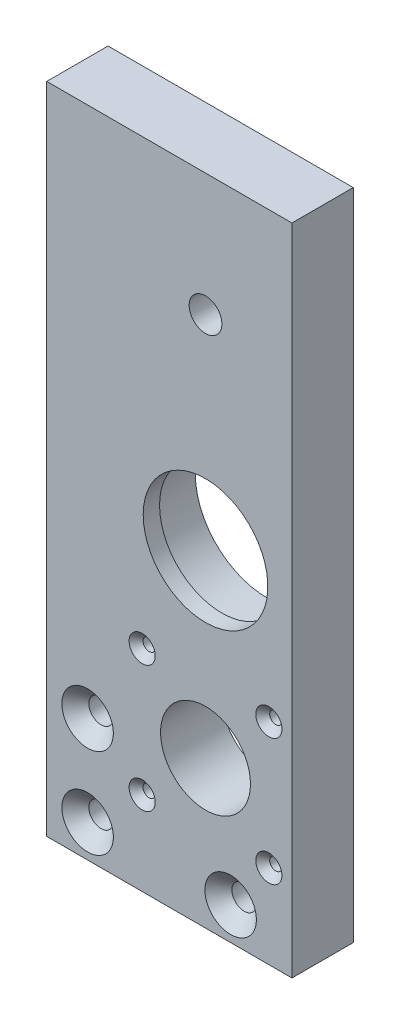
ISO-10303-21;
HEADER;
FILE_DESCRIPTION(('STEP AP214'),'2;1');
FILE_NAME('part.step','',(''),(''),'','','');
FILE_SCHEMA(('AUTOMOTIVE_DESIGN { 1 0 10303 214 1 1 1 1 }'));
ENDSEC;
DATA;
#1=APPLICATION_CONTEXT('core data for automotive mechanical design processes');
#2=APPLICATION_PROTOCOL_DEFINITION('international standard','automotive_design',2000,#1);
#3=PRODUCT_CONTEXT('',#1,'mechanical');
#4=PRODUCT('Part','Part','',(#3));
#5=PRODUCT_RELATED_PRODUCT_CATEGORY('part','',(#4));
#6=PRODUCT_DEFINITION_FORMATION('','',#4);
#7=PRODUCT_DEFINITION_CONTEXT('part definition',#1,'design');
#8=PRODUCT_DEFINITION('design','',#6,#7);
#9=PRODUCT_DEFINITION_SHAPE('','',#8);
#10=(LENGTH_UNIT() NAMED_UNIT(*) SI_UNIT(.MILLI.,.METRE.));
#11=(NAMED_UNIT(*) PLANE_ANGLE_UNIT() SI_UNIT($,.RADIAN.));
#12=(NAMED_UNIT(*) SI_UNIT($,.STERADIAN.) SOLID_ANGLE_UNIT());
#13=UNCERTAINTY_MEASURE_WITH_UNIT(LENGTH_MEASURE(1.E-05),#10,'distance_accuracy_value','');
#14=(GEOMETRIC_REPRESENTATION_CONTEXT(3) GLOBAL_UNCERTAINTY_ASSIGNED_CONTEXT((#13)) GLOBAL_UNIT_ASSIGNED_CONTEXT((#10,
#11,#12)) REPRESENTATION_CONTEXT('',''));
#15=CARTESIAN_POINT('',(0.,0.,0.));
#16=DIRECTION('',(0.,0.,1.));
#17=DIRECTION('',(1.,0.,0.));
#18=AXIS2_PLACEMENT_3D('',#15,#16,#17);
#19=CARTESIAN_POINT('',(0.,0.,15.));
#20=DIRECTION('',(0.,1.,0.));
#21=DIRECTION('',(0.,0.,1.));
#22=AXIS2_PLACEMENT_3D('',#19,#20,#21);
#23=PLANE('',#22);
#24=DIRECTION('',(0.,0.,1.));
#25=VECTOR('',#24,1.);
#26=CARTESIAN_POINT('',(5.,0.,0.));
#27=LINE('',#26,#25);
#28=CARTESIAN_POINT('',(5.,0.,0.));
#29=VERTEX_POINT('',#28);
#30=CARTESIAN_POINT('',(5.,0.,15.));
#31=VERTEX_POINT('',#30);
#32=EDGE_CURVE('E261',#29,#31,#27,.T.);
#33=ORIENTED_EDGE('',*,*,#32,.F.);
#34=DIRECTION('',(1.,0.,0.));
#35=VECTOR('',#34,1.);
#36=CARTESIAN_POINT('',(0.,0.,0.));
#37=LINE('',#36,#35);
#38=CARTESIAN_POINT('',(65.,0.,0.));
#39=VERTEX_POINT('',#38);
#40=EDGE_CURVE('E82',#29,#39,#37,.T.);
#41=ORIENTED_EDGE('',*,*,#40,.T.);
#42=DIRECTION('',(0.,0.,-1.));
#43=VECTOR('',#42,1.);
#44=CARTESIAN_POINT('',(65.,0.,15.));
#45=LINE('',#44,#43);
#46=CARTESIAN_POINT('',(65.,0.,15.));
#47=VERTEX_POINT('',#46);
#48=EDGE_CURVE('E77',#47,#39,#45,.T.);
#49=ORIENTED_EDGE('',*,*,#48,.F.);
#50=DIRECTION('',(1.,0.,0.));
#51=VECTOR('',#50,1.);
#52=CARTESIAN_POINT('',(0.,0.,15.));
#53=LINE('',#52,#51);
#54=EDGE_CURVE('E91',#31,#47,#53,.T.);
#55=ORIENTED_EDGE('',*,*,#54,.F.);
#56=EDGE_LOOP('',(#33,#41,#49,#55));
#57=FACE_BOUND('',#56,.T.);
#58=ADVANCED_FACE('F33',(#57),#23,.F.);
#59=CARTESIAN_POINT('',(0.,160.,15.));
#60=DIRECTION('',(0.,-1.,0.));
#61=DIRECTION('',(0.,0.,-1.));
#62=AXIS2_PLACEMENT_3D('',#59,#60,#61);
#63=PLANE('',#62);
#64=DIRECTION('',(0.,0.,-1.));
#65=VECTOR('',#64,1.);
#66=CARTESIAN_POINT('',(5.,160.,0.));
#67=LINE('',#66,#65);
#68=CARTESIAN_POINT('',(5.,160.,15.));
#69=VERTEX_POINT('',#68);
#70=CARTESIAN_POINT('',(5.,160.,0.));
#71=VERTEX_POINT('',#70);
#72=EDGE_CURVE('E49',#69,#71,#67,.T.);
#73=ORIENTED_EDGE('',*,*,#72,.F.);
#74=DIRECTION('',(-1.,0.,0.));
#75=VECTOR('',#74,1.);
#76=CARTESIAN_POINT('',(0.,160.,15.));
#77=LINE('',#76,#75);
#78=CARTESIAN_POINT('',(65.,160.,15.));
#79=VERTEX_POINT('',#78);
#80=EDGE_CURVE('E87',#79,#69,#77,.T.);
#81=ORIENTED_EDGE('',*,*,#80,.F.);
#82=DIRECTION('',(0.,0.,-1.));
#83=VECTOR('',#82,1.);
#84=CARTESIAN_POINT('',(65.,160.,15.));
#85=LINE('',#84,#83);
#86=CARTESIAN_POINT('',(65.,160.,0.));
#87=VERTEX_POINT('',#86);
#88=EDGE_CURVE('E74',#79,#87,#85,.T.);
#89=ORIENTED_EDGE('',*,*,#88,.T.);
#90=DIRECTION('',(-1.,0.,0.));
#91=VECTOR('',#90,1.);
#92=CARTESIAN_POINT('',(0.,160.,0.));
#93=LINE('',#92,#91);
#94=EDGE_CURVE('E81',#87,#71,#93,.T.);
#95=ORIENTED_EDGE('',*,*,#94,.T.);
#96=EDGE_LOOP('',(#73,#81,#89,#95));
#97=FACE_BOUND('',#96,.T.);
#98=ADVANCED_FACE('F86',(#97),#63,.F.);
#99=CARTESIAN_POINT('',(0.,0.,15.));
#100=DIRECTION('',(0.,0.,-1.));
#101=DIRECTION('',(-1.,0.,0.));
#102=AXIS2_PLACEMENT_3D('',#99,#100,#101);
#103=PLANE('',#102);
#104=CARTESIAN_POINT('',(43.85,80.,15.));
#105=DIRECTION('',(0.,0.,-1.));
#106=DIRECTION('',(-1.,0.,0.));
#107=AXIS2_PLACEMENT_3D('',#104,#105,#106);
#108=CIRCLE('',#107,15.25);
#109=CARTESIAN_POINT('',(28.6,80.,15.));
#110=VERTEX_POINT('',#109);
#111=EDGE_CURVE('E248',#110,#110,#108,.T.);
#112=ORIENTED_EDGE('',*,*,#111,.T.);
#113=EDGE_LOOP('',(#112));
#114=FACE_BOUND('',#113,.T.);
#115=CARTESIAN_POINT('',(43.85,36.,15.));
#116=DIRECTION('',(0.,0.,1.));
#117=DIRECTION('',(1.,0.,0.));
#118=AXIS2_PLACEMENT_3D('',#115,#116,#117);
#119=CIRCLE('',#118,11.);
#120=CARTESIAN_POINT('',(54.85,36.,15.));
#121=VERTEX_POINT('',#120);
#122=EDGE_CURVE('E102',#121,#121,#119,.T.);
#123=ORIENTED_EDGE('',*,*,#122,.F.);
#124=EDGE_LOOP('',(#123));
#125=FACE_BOUND('',#124,.T.);
#126=CARTESIAN_POINT('',(15.,8.00000000000001,15.));
#127=DIRECTION('',(0.,0.,-1.));
#128=DIRECTION('',(-1.,0.,0.));
#129=AXIS2_PLACEMENT_3D('',#126,#127,#128);
#130=CIRCLE('',#129,6.3);
#131=CARTESIAN_POINT('',(8.7,8.00000000000001,15.));
#132=VERTEX_POINT('',#131);
#133=EDGE_CURVE('E112',#132,#132,#130,.T.);
#134=ORIENTED_EDGE('',*,*,#133,.T.);
#135=EDGE_LOOP('',(#134));
#136=FACE_BOUND('',#135,.T.);
#137=CARTESIAN_POINT('',(50.,8.,15.));
#138=DIRECTION('',(0.,0.,-1.));
#139=DIRECTION('',(-1.,0.,0.));
#140=AXIS2_PLACEMENT_3D('',#137,#138,#139);
#141=CIRCLE('',#140,6.3);
#142=CARTESIAN_POINT('',(43.7,8.,15.));
#143=VERTEX_POINT('',#142);
#144=EDGE_CURVE('E115',#143,#143,#141,.T.);
#145=ORIENTED_EDGE('',*,*,#144,.T.);
#146=EDGE_LOOP('',(#145));
#147=FACE_BOUND('',#146,.T.);
#148=CARTESIAN_POINT('',(15.,30.,15.));
#149=DIRECTION('',(0.,0.,-1.));
#150=DIRECTION('',(-1.,0.,0.));
#151=AXIS2_PLACEMENT_3D('',#148,#149,#150);
#152=CIRCLE('',#151,6.29999999999997);
#153=CARTESIAN_POINT('',(8.70000000000003,30.,15.));
#154=VERTEX_POINT('',#153);
#155=EDGE_CURVE('E127',#154,#154,#152,.T.);
#156=ORIENTED_EDGE('',*,*,#155,.T.);
#157=EDGE_LOOP('',(#156));
#158=FACE_BOUND('',#157,.T.);
#159=CARTESIAN_POINT('',(59.35,20.5,15.));
#160=DIRECTION('',(0.,0.,-1.));
#161=DIRECTION('',(-1.,0.,0.));
#162=AXIS2_PLACEMENT_3D('',#159,#160,#161);
#163=CIRCLE('',#162,3.20000000000004);
#164=CARTESIAN_POINT('',(56.15,20.5,15.));
#165=VERTEX_POINT('',#164);
#166=EDGE_CURVE('E144',#165,#165,#163,.T.);
#167=ORIENTED_EDGE('',*,*,#166,.T.);
#168=EDGE_LOOP('',(#167));
#169=FACE_BOUND('',#168,.T.);
#170=CARTESIAN_POINT('',(28.35,20.5,15.));
#171=DIRECTION('',(0.,0.,-1.));
#172=DIRECTION('',(-1.,0.,0.));
#173=AXIS2_PLACEMENT_3D('',#170,#171,#172);
#174=CIRCLE('',#173,3.20000000000004);
#175=CARTESIAN_POINT('',(25.15,20.5,15.));
#176=VERTEX_POINT('',#175);
#177=EDGE_CURVE('E147',#176,#176,#174,.T.);
#178=ORIENTED_EDGE('',*,*,#177,.T.);
#179=EDGE_LOOP('',(#178));
#180=FACE_BOUND('',#179,.T.);
#181=CARTESIAN_POINT('',(28.35,51.5,15.));
#182=DIRECTION('',(0.,0.,-1.));
#183=DIRECTION('',(-1.,0.,0.));
#184=AXIS2_PLACEMENT_3D('',#181,#182,#183);
#185=CIRCLE('',#184,3.20000000000004);
#186=CARTESIAN_POINT('',(25.15,51.5,15.));
#187=VERTEX_POINT('',#186);
#188=EDGE_CURVE('E150',#187,#187,#185,.T.);
#189=ORIENTED_EDGE('',*,*,#188,.T.);
#190=EDGE_LOOP('',(#189));
#191=FACE_BOUND('',#190,.T.);
#192=CARTESIAN_POINT('',(59.35,51.5,15.));
#193=DIRECTION('',(0.,0.,-1.));
#194=DIRECTION('',(-1.,0.,0.));
#195=AXIS2_PLACEMENT_3D('',#192,#193,#194);
#196=CIRCLE('',#195,3.20000000000004);
#197=CARTESIAN_POINT('',(56.15,51.5,15.));
#198=VERTEX_POINT('',#197);
#199=EDGE_CURVE('E153',#198,#198,#196,.T.);
#200=ORIENTED_EDGE('',*,*,#199,.T.);
#201=EDGE_LOOP('',(#200));
#202=FACE_BOUND('',#201,.T.);
#203=CARTESIAN_POINT('',(43.85,130.,15.));
#204=DIRECTION('',(0.,0.,1.));
#205=DIRECTION('',(1.,0.,0.));
#206=AXIS2_PLACEMENT_3D('',#203,#204,#205);
#207=CIRCLE('',#206,4.00000000000001);
#208=CARTESIAN_POINT('',(47.85,130.,15.));
#209=VERTEX_POINT('',#208);
#210=EDGE_CURVE('E235',#209,#209,#207,.T.);
#211=ORIENTED_EDGE('',*,*,#210,.F.);
#212=EDGE_LOOP('',(#211));
#213=FACE_BOUND('',#212,.T.);
#214=DIRECTION('',(0.,1.,0.));
#215=VECTOR('',#214,1.);
#216=CARTESIAN_POINT('',(5.,160.,15.));
#217=LINE('',#216,#215);
#218=EDGE_CURVE('E240',#31,#69,#217,.T.);
#219=ORIENTED_EDGE('',*,*,#218,.F.);
#220=ORIENTED_EDGE('',*,*,#54,.T.);
#221=DIRECTION('',(0.,1.,0.));
#222=VECTOR('',#221,1.);
#223=CARTESIAN_POINT('',(65.,0.,15.));
#224=LINE('',#223,#222);
#225=EDGE_CURVE('E58',#47,#79,#224,.T.);
#226=ORIENTED_EDGE('',*,*,#225,.T.);
#227=ORIENTED_EDGE('',*,*,#80,.T.);
#228=EDGE_LOOP('',(#219,#220,#226,#227));
#229=FACE_BOUND('',#228,.T.);
#230=ADVANCED_FACE('F185',(#114,#125,#136,#147,#158,#169,#180,#191,#202,#213,#229),#103,.F.);
#231=CARTESIAN_POINT('',(0.,0.,0.));
#232=DIRECTION('',(0.,0.,-1.));
#233=DIRECTION('',(-1.,0.,0.));
#234=AXIS2_PLACEMENT_3D('',#231,#232,#233);
#235=PLANE('',#234);
#236=CARTESIAN_POINT('',(43.85,80.,0.));
#237=DIRECTION('',(0.,0.,-1.));
#238=DIRECTION('',(-1.,0.,0.));
#239=AXIS2_PLACEMENT_3D('',#236,#237,#238);
#240=CIRCLE('',#239,17.5);
#241=CARTESIAN_POINT('',(26.35,80.,0.));
#242=VERTEX_POINT('',#241);
#243=EDGE_CURVE('E251',#242,#242,#240,.T.);
#244=ORIENTED_EDGE('',*,*,#243,.F.);
#245=EDGE_LOOP('',(#244));
#246=FACE_BOUND('',#245,.T.);
#247=CARTESIAN_POINT('',(43.85,36.,0.));
#248=DIRECTION('',(0.,0.,-1.));
#249=DIRECTION('',(-1.,0.,0.));
#250=AXIS2_PLACEMENT_3D('',#247,#248,#249);
#251=CIRCLE('',#250,11.);
#252=CARTESIAN_POINT('',(32.85,36.,0.));
#253=VERTEX_POINT('',#252);
#254=EDGE_CURVE('E98',#253,#253,#251,.T.);
#255=ORIENTED_EDGE('',*,*,#254,.F.);
#256=EDGE_LOOP('',(#255));
#257=FACE_BOUND('',#256,.T.);
#258=CARTESIAN_POINT('',(15.,8.00000000000001,0.));
#259=DIRECTION('',(0.,0.,-1.));
#260=DIRECTION('',(-1.,0.,0.));
#261=AXIS2_PLACEMENT_3D('',#258,#259,#260);
#262=CIRCLE('',#261,3.);
#263=CARTESIAN_POINT('',(12.,8.00000000000001,0.));
#264=VERTEX_POINT('',#263);
#265=EDGE_CURVE('E103',#264,#264,#262,.T.);
#266=ORIENTED_EDGE('',*,*,#265,.F.);
#267=EDGE_LOOP('',(#266));
#268=FACE_BOUND('',#267,.T.);
#269=CARTESIAN_POINT('',(50.,8.,0.));
#270=DIRECTION('',(0.,0.,-1.));
#271=DIRECTION('',(-1.,0.,0.));
#272=AXIS2_PLACEMENT_3D('',#269,#270,#271);
#273=CIRCLE('',#272,3.);
#274=CARTESIAN_POINT('',(47.,8.,0.));
#275=VERTEX_POINT('',#274);
#276=EDGE_CURVE('E106',#275,#275,#273,.T.);
#277=ORIENTED_EDGE('',*,*,#276,.F.);
#278=EDGE_LOOP('',(#277));
#279=FACE_BOUND('',#278,.T.);
#280=CARTESIAN_POINT('',(15.,30.,0.));
#281=DIRECTION('',(0.,0.,-1.));
#282=DIRECTION('',(-1.,0.,0.));
#283=AXIS2_PLACEMENT_3D('',#280,#281,#282);
#284=CIRCLE('',#283,3.);
#285=CARTESIAN_POINT('',(12.,30.,0.));
#286=VERTEX_POINT('',#285);
#287=EDGE_CURVE('E109',#286,#286,#284,.T.);
#288=ORIENTED_EDGE('',*,*,#287,.F.);
#289=EDGE_LOOP('',(#288));
#290=FACE_BOUND('',#289,.T.);
#291=CARTESIAN_POINT('',(59.35,51.5,0.));
#292=DIRECTION('',(0.,0.,-1.));
#293=DIRECTION('',(-1.,0.,0.));
#294=AXIS2_PLACEMENT_3D('',#291,#292,#293);
#295=CIRCLE('',#294,1.5);
#296=CARTESIAN_POINT('',(57.85,51.5,0.));
#297=VERTEX_POINT('',#296);
#298=EDGE_CURVE('E124',#297,#297,#295,.T.);
#299=ORIENTED_EDGE('',*,*,#298,.F.);
#300=EDGE_LOOP('',(#299));
#301=FACE_BOUND('',#300,.T.);
#302=CARTESIAN_POINT('',(59.35,20.5,0.));
#303=DIRECTION('',(0.,0.,-1.));
#304=DIRECTION('',(-1.,0.,0.));
#305=AXIS2_PLACEMENT_3D('',#302,#303,#304);
#306=CIRCLE('',#305,1.5);
#307=CARTESIAN_POINT('',(57.85,20.5,0.));
#308=VERTEX_POINT('',#307);
#309=EDGE_CURVE('E133',#308,#308,#306,.T.);
#310=ORIENTED_EDGE('',*,*,#309,.F.);
#311=EDGE_LOOP('',(#310));
#312=FACE_BOUND('',#311,.T.);
#313=CARTESIAN_POINT('',(28.35,51.5,0.));
#314=DIRECTION('',(0.,0.,-1.));
#315=DIRECTION('',(-1.,0.,0.));
#316=AXIS2_PLACEMENT_3D('',#313,#314,#315);
#317=CIRCLE('',#316,1.5);
#318=CARTESIAN_POINT('',(26.85,51.5,0.));
#319=VERTEX_POINT('',#318);
#320=EDGE_CURVE('E136',#319,#319,#317,.T.);
#321=ORIENTED_EDGE('',*,*,#320,.F.);
#322=EDGE_LOOP('',(#321));
#323=FACE_BOUND('',#322,.T.);
#324=CARTESIAN_POINT('',(28.35,20.5,0.));
#325=DIRECTION('',(0.,0.,-1.));
#326=DIRECTION('',(-1.,0.,0.));
#327=AXIS2_PLACEMENT_3D('',#324,#325,#326);
#328=CIRCLE('',#327,1.5);
#329=CARTESIAN_POINT('',(26.85,20.5,0.));
#330=VERTEX_POINT('',#329);
#331=EDGE_CURVE('E139',#330,#330,#328,.T.);
#332=ORIENTED_EDGE('',*,*,#331,.F.);
#333=EDGE_LOOP('',(#332));
#334=FACE_BOUND('',#333,.T.);
#335=CARTESIAN_POINT('',(43.85,130.,0.));
#336=DIRECTION('',(0.,0.,-1.));
#337=DIRECTION('',(-1.,0.,0.));
#338=AXIS2_PLACEMENT_3D('',#335,#336,#337);
#339=CIRCLE('',#338,4.00000000000001);
#340=CARTESIAN_POINT('',(39.85,130.,0.));
#341=VERTEX_POINT('',#340);
#342=EDGE_CURVE('E37',#341,#341,#339,.T.);
#343=ORIENTED_EDGE('',*,*,#342,.F.);
#344=EDGE_LOOP('',(#343));
#345=FACE_BOUND('',#344,.T.);
#346=ORIENTED_EDGE('',*,*,#40,.F.);
#347=DIRECTION('',(0.,-1.,0.));
#348=VECTOR('',#347,1.);
#349=CARTESIAN_POINT('',(5.,160.,0.));
#350=LINE('',#349,#348);
#351=EDGE_CURVE('E90',#71,#29,#350,.T.);
#352=ORIENTED_EDGE('',*,*,#351,.F.);
#353=ORIENTED_EDGE('',*,*,#94,.F.);
#354=DIRECTION('',(0.,1.,0.));
#355=VECTOR('',#354,1.);
#356=CARTESIAN_POINT('',(65.,0.,0.));
#357=LINE('',#356,#355);
#358=EDGE_CURVE('E71',#39,#87,#357,.T.);
#359=ORIENTED_EDGE('',*,*,#358,.F.);
#360=EDGE_LOOP('',(#346,#352,#353,#359));
#361=FACE_BOUND('',#360,.T.);
#362=ADVANCED_FACE('F89',(#246,#257,#268,#279,#290,#301,#312,#323,#334,#345,#361),#235,.T.);
#363=CARTESIAN_POINT('',(65.,0.,15.));
#364=DIRECTION('',(-1.,0.,0.));
#365=DIRECTION('',(0.,0.,1.));
#366=AXIS2_PLACEMENT_3D('',#363,#364,#365);
#367=PLANE('',#366);
#368=ORIENTED_EDGE('',*,*,#358,.T.);
#369=ORIENTED_EDGE('',*,*,#88,.F.);
#370=ORIENTED_EDGE('',*,*,#225,.F.);
#371=ORIENTED_EDGE('',*,*,#48,.T.);
#372=EDGE_LOOP('',(#368,#369,#370,#371));
#373=FACE_BOUND('',#372,.T.);
#374=ADVANCED_FACE('F73',(#373),#367,.F.);
#375=CARTESIAN_POINT('',(43.85,80.,11.));
#376=DIRECTION('',(0.,0.,-1.));
#377=DIRECTION('',(-1.,0.,0.));
#378=AXIS2_PLACEMENT_3D('',#375,#376,#377);
#379=CYLINDRICAL_SURFACE('',#378,17.5);
#380=CARTESIAN_POINT('',(43.85,80.,11.));
#381=DIRECTION('',(0.,0.,-1.));
#382=DIRECTION('',(-1.,0.,0.));
#383=AXIS2_PLACEMENT_3D('',#380,#381,#382);
#384=CIRCLE('',#383,17.5);
#385=CARTESIAN_POINT('',(26.35,80.,11.));
#386=VERTEX_POINT('',#385);
#387=EDGE_CURVE('E252',#386,#386,#384,.T.);
#388=ORIENTED_EDGE('',*,*,#387,.F.);
#389=EDGE_LOOP('',(#388));
#390=FACE_BOUND('',#389,.T.);
#391=ORIENTED_EDGE('',*,*,#243,.T.);
#392=EDGE_LOOP('',(#391));
#393=FACE_BOUND('',#392,.T.);
#394=ADVANCED_FACE('F274',(#390,#393),#379,.F.);
#395=CARTESIAN_POINT('',(43.85,80.,11.));
#396=DIRECTION('',(0.,0.,-1.));
#397=DIRECTION('',(-1.,0.,0.));
#398=AXIS2_PLACEMENT_3D('',#395,#396,#397);
#399=PLANE('',#398);
#400=CARTESIAN_POINT('',(43.85,80.,11.));
#401=DIRECTION('',(0.,0.,-1.));
#402=DIRECTION('',(-1.,0.,0.));
#403=AXIS2_PLACEMENT_3D('',#400,#401,#402);
#404=CIRCLE('',#403,15.25);
#405=CARTESIAN_POINT('',(28.6,80.,11.));
#406=VERTEX_POINT('',#405);
#407=EDGE_CURVE('E101',#406,#406,#404,.T.);
#408=ORIENTED_EDGE('',*,*,#407,.F.);
#409=EDGE_LOOP('',(#408));
#410=FACE_BOUND('',#409,.T.);
#411=ORIENTED_EDGE('',*,*,#387,.T.);
#412=EDGE_LOOP('',(#411));
#413=FACE_BOUND('',#412,.T.);
#414=ADVANCED_FACE('F277',(#410,#413),#399,.T.);
#415=CARTESIAN_POINT('',(43.85,80.,21.));
#416=DIRECTION('',(0.,0.,-1.));
#417=DIRECTION('',(-1.,0.,0.));
#418=AXIS2_PLACEMENT_3D('',#415,#416,#417);
#419=CYLINDRICAL_SURFACE('',#418,15.25);
#420=ORIENTED_EDGE('',*,*,#407,.T.);
#421=EDGE_LOOP('',(#420));
#422=FACE_BOUND('',#421,.T.);
#423=ORIENTED_EDGE('',*,*,#111,.F.);
#424=EDGE_LOOP('',(#423));
#425=FACE_BOUND('',#424,.T.);
#426=ADVANCED_FACE('F281',(#422,#425),#419,.F.);
#427=CARTESIAN_POINT('',(43.85,36.,-5.));
#428=DIRECTION('',(0.,0.,1.));
#429=DIRECTION('',(1.,0.,0.));
#430=AXIS2_PLACEMENT_3D('',#427,#428,#429);
#431=CYLINDRICAL_SURFACE('',#430,11.);
#432=ORIENTED_EDGE('',*,*,#254,.T.);
#433=EDGE_LOOP('',(#432));
#434=FACE_BOUND('',#433,.T.);
#435=ORIENTED_EDGE('',*,*,#122,.T.);
#436=EDGE_LOOP('',(#435));
#437=FACE_BOUND('',#436,.T.);
#438=ADVANCED_FACE('F285',(#434,#437),#431,.F.);
#439=CARTESIAN_POINT('',(15.,8.00000000000001,-2.));
#440=DIRECTION('',(0.,0.,1.));
#441=DIRECTION('',(1.,0.,0.));
#442=AXIS2_PLACEMENT_3D('',#439,#440,#441);
#443=CYLINDRICAL_SURFACE('',#442,3.);
#444=CARTESIAN_POINT('',(15.,8.00000000000001,11.7));
#445=DIRECTION('',(0.,0.,-1.));
#446=DIRECTION('',(-1.,0.,0.));
#447=AXIS2_PLACEMENT_3D('',#444,#445,#446);
#448=CIRCLE('',#447,3.);
#449=CARTESIAN_POINT('',(12.,8.00000000000001,11.7));
#450=VERTEX_POINT('',#449);
#451=EDGE_CURVE('E118',#450,#450,#448,.F.);
#452=ORIENTED_EDGE('',*,*,#451,.T.);
#453=EDGE_LOOP('',(#452));
#454=FACE_BOUND('',#453,.T.);
#455=ORIENTED_EDGE('',*,*,#265,.T.);
#456=EDGE_LOOP('',(#455));
#457=FACE_BOUND('',#456,.T.);
#458=ADVANCED_FACE('F289',(#454,#457),#443,.F.);
#459=CARTESIAN_POINT('',(50.,8.,-2.));
#460=DIRECTION('',(0.,0.,1.));
#461=DIRECTION('',(1.,0.,0.));
#462=AXIS2_PLACEMENT_3D('',#459,#460,#461);
#463=CYLINDRICAL_SURFACE('',#462,3.);
#464=CARTESIAN_POINT('',(50.,8.,11.7));
#465=DIRECTION('',(0.,0.,-1.));
#466=DIRECTION('',(-1.,0.,0.));
#467=AXIS2_PLACEMENT_3D('',#464,#465,#466);
#468=CIRCLE('',#467,3.);
#469=CARTESIAN_POINT('',(47.,8.,11.7));
#470=VERTEX_POINT('',#469);
#471=EDGE_CURVE('E97',#470,#470,#468,.F.);
#472=ORIENTED_EDGE('',*,*,#471,.T.);
#473=EDGE_LOOP('',(#472));
#474=FACE_BOUND('',#473,.T.);
#475=ORIENTED_EDGE('',*,*,#276,.T.);
#476=EDGE_LOOP('',(#475));
#477=FACE_BOUND('',#476,.T.);
#478=ADVANCED_FACE('F194',(#474,#477),#463,.F.);
#479=CARTESIAN_POINT('',(50.,8.,11.7));
#480=DIRECTION('',(0.,0.,1.));
#481=DIRECTION('',(1.,0.,0.));
#482=AXIS2_PLACEMENT_3D('',#479,#480,#481);
#483=CONICAL_SURFACE('',#482,3.,0.785398163397447);
#484=ORIENTED_EDGE('',*,*,#144,.F.);
#485=EDGE_LOOP('',(#484));
#486=FACE_BOUND('',#485,.T.);
#487=ORIENTED_EDGE('',*,*,#471,.F.);
#488=EDGE_LOOP('',(#487));
#489=FACE_BOUND('',#488,.T.);
#490=ADVANCED_FACE('F190',(#486,#489),#483,.F.);
#491=CARTESIAN_POINT('',(15.,8.00000000000001,11.7));
#492=DIRECTION('',(0.,0.,1.));
#493=DIRECTION('',(1.,0.,0.));
#494=AXIS2_PLACEMENT_3D('',#491,#492,#493);
#495=CONICAL_SURFACE('',#494,3.,0.785398163397447);
#496=ORIENTED_EDGE('',*,*,#133,.F.);
#497=EDGE_LOOP('',(#496));
#498=FACE_BOUND('',#497,.T.);
#499=ORIENTED_EDGE('',*,*,#451,.F.);
#500=EDGE_LOOP('',(#499));
#501=FACE_BOUND('',#500,.T.);
#502=ADVANCED_FACE('F193',(#498,#501),#495,.F.);
#503=CARTESIAN_POINT('',(15.,30.,-14.));
#504=DIRECTION('',(0.,0.,1.));
#505=DIRECTION('',(1.,0.,0.));
#506=AXIS2_PLACEMENT_3D('',#503,#504,#505);
#507=CYLINDRICAL_SURFACE('',#506,3.);
#508=CARTESIAN_POINT('',(15.,30.,11.7));
#509=DIRECTION('',(0.,0.,-1.));
#510=DIRECTION('',(-1.,0.,0.));
#511=AXIS2_PLACEMENT_3D('',#508,#509,#510);
#512=CIRCLE('',#511,3.);
#513=CARTESIAN_POINT('',(12.,30.,11.7));
#514=VERTEX_POINT('',#513);
#515=EDGE_CURVE('E121',#514,#514,#512,.F.);
#516=ORIENTED_EDGE('',*,*,#515,.T.);
#517=EDGE_LOOP('',(#516));
#518=FACE_BOUND('',#517,.T.);
#519=ORIENTED_EDGE('',*,*,#287,.T.);
#520=EDGE_LOOP('',(#519));
#521=FACE_BOUND('',#520,.T.);
#522=ADVANCED_FACE('F198',(#518,#521),#507,.F.);
#523=CARTESIAN_POINT('',(15.,30.,11.7));
#524=DIRECTION('',(0.,0.,1.));
#525=DIRECTION('',(1.,0.,0.));
#526=AXIS2_PLACEMENT_3D('',#523,#524,#525);
#527=CONICAL_SURFACE('',#526,3.,0.78539816339745);
#528=ORIENTED_EDGE('',*,*,#155,.F.);
#529=EDGE_LOOP('',(#528));
#530=FACE_BOUND('',#529,.T.);
#531=ORIENTED_EDGE('',*,*,#515,.F.);
#532=EDGE_LOOP('',(#531));
#533=FACE_BOUND('',#532,.T.);
#534=ADVANCED_FACE('F200',(#530,#533),#527,.F.);
#535=CARTESIAN_POINT('',(59.35,51.5,-29.));
#536=DIRECTION('',(0.,0.,1.));
#537=DIRECTION('',(1.,0.,0.));
#538=AXIS2_PLACEMENT_3D('',#535,#536,#537);
#539=CYLINDRICAL_SURFACE('',#538,1.5);
#540=CARTESIAN_POINT('',(59.35,51.5,13.3));
#541=DIRECTION('',(0.,0.,-1.));
#542=DIRECTION('',(-1.,0.,0.));
#543=AXIS2_PLACEMENT_3D('',#540,#541,#542);
#544=CIRCLE('',#543,1.5);
#545=CARTESIAN_POINT('',(57.85,51.5,13.3));
#546=VERTEX_POINT('',#545);
#547=EDGE_CURVE('E130',#546,#546,#544,.F.);
#548=ORIENTED_EDGE('',*,*,#547,.T.);
#549=EDGE_LOOP('',(#548));
#550=FACE_BOUND('',#549,.T.);
#551=ORIENTED_EDGE('',*,*,#298,.T.);
#552=EDGE_LOOP('',(#551));
#553=FACE_BOUND('',#552,.T.);
#554=ADVANCED_FACE('F203',(#550,#553),#539,.F.);
#555=CARTESIAN_POINT('',(59.35,20.5,-29.));
#556=DIRECTION('',(0.,0.,1.));
#557=DIRECTION('',(1.,0.,0.));
#558=AXIS2_PLACEMENT_3D('',#555,#556,#557);
#559=CYLINDRICAL_SURFACE('',#558,1.5);
#560=CARTESIAN_POINT('',(59.35,20.5,13.3));
#561=DIRECTION('',(0.,0.,-1.));
#562=DIRECTION('',(-1.,0.,0.));
#563=AXIS2_PLACEMENT_3D('',#560,#561,#562);
#564=CIRCLE('',#563,1.5);
#565=CARTESIAN_POINT('',(57.85,20.5,13.3));
#566=VERTEX_POINT('',#565);
#567=EDGE_CURVE('E11',#566,#566,#564,.F.);
#568=ORIENTED_EDGE('',*,*,#567,.T.);
#569=EDGE_LOOP('',(#568));
#570=FACE_BOUND('',#569,.T.);
#571=ORIENTED_EDGE('',*,*,#309,.T.);
#572=EDGE_LOOP('',(#571));
#573=FACE_BOUND('',#572,.T.);
#574=ADVANCED_FACE('F218',(#570,#573),#559,.F.);
#575=CARTESIAN_POINT('',(28.35,51.5,-29.));
#576=DIRECTION('',(0.,0.,1.));
#577=DIRECTION('',(1.,0.,0.));
#578=AXIS2_PLACEMENT_3D('',#575,#576,#577);
#579=CYLINDRICAL_SURFACE('',#578,1.5);
#580=CARTESIAN_POINT('',(28.35,51.5,13.3));
#581=DIRECTION('',(0.,0.,-1.));
#582=DIRECTION('',(-1.,0.,0.));
#583=AXIS2_PLACEMENT_3D('',#580,#581,#582);
#584=CIRCLE('',#583,1.5);
#585=CARTESIAN_POINT('',(26.85,51.5,13.3));
#586=VERTEX_POINT('',#585);
#587=EDGE_CURVE('E156',#586,#586,#584,.F.);
#588=ORIENTED_EDGE('',*,*,#587,.T.);
#589=EDGE_LOOP('',(#588));
#590=FACE_BOUND('',#589,.T.);
#591=ORIENTED_EDGE('',*,*,#320,.T.);
#592=EDGE_LOOP('',(#591));
#593=FACE_BOUND('',#592,.T.);
#594=ADVANCED_FACE('F210',(#590,#593),#579,.F.);
#595=CARTESIAN_POINT('',(28.35,20.5,-29.));
#596=DIRECTION('',(0.,0.,1.));
#597=DIRECTION('',(1.,0.,0.));
#598=AXIS2_PLACEMENT_3D('',#595,#596,#597);
#599=CYLINDRICAL_SURFACE('',#598,1.5);
#600=CARTESIAN_POINT('',(28.35,20.5,13.3));
#601=DIRECTION('',(0.,0.,-1.));
#602=DIRECTION('',(-1.,0.,0.));
#603=AXIS2_PLACEMENT_3D('',#600,#601,#602);
#604=CIRCLE('',#603,1.5);
#605=CARTESIAN_POINT('',(26.85,20.5,13.3));
#606=VERTEX_POINT('',#605);
#607=EDGE_CURVE('E42',#606,#606,#604,.F.);
#608=ORIENTED_EDGE('',*,*,#607,.T.);
#609=EDGE_LOOP('',(#608));
#610=FACE_BOUND('',#609,.T.);
#611=ORIENTED_EDGE('',*,*,#331,.T.);
#612=EDGE_LOOP('',(#611));
#613=FACE_BOUND('',#612,.T.);
#614=ADVANCED_FACE('F162',(#610,#613),#599,.F.);
#615=CARTESIAN_POINT('',(59.35,51.5,13.3));
#616=DIRECTION('',(0.,0.,1.));
#617=DIRECTION('',(1.,0.,0.));
#618=AXIS2_PLACEMENT_3D('',#615,#616,#617);
#619=CONICAL_SURFACE('',#618,1.5,0.785398163397451);
#620=ORIENTED_EDGE('',*,*,#199,.F.);
#621=EDGE_LOOP('',(#620));
#622=FACE_BOUND('',#621,.T.);
#623=ORIENTED_EDGE('',*,*,#547,.F.);
#624=EDGE_LOOP('',(#623));
#625=FACE_BOUND('',#624,.T.);
#626=ADVANCED_FACE('F175',(#622,#625),#619,.F.);
#627=CARTESIAN_POINT('',(28.35,51.5,13.3));
#628=DIRECTION('',(0.,0.,1.));
#629=DIRECTION('',(1.,0.,0.));
#630=AXIS2_PLACEMENT_3D('',#627,#628,#629);
#631=CONICAL_SURFACE('',#630,1.5,0.785398163397452);
#632=ORIENTED_EDGE('',*,*,#188,.F.);
#633=EDGE_LOOP('',(#632));
#634=FACE_BOUND('',#633,.T.);
#635=ORIENTED_EDGE('',*,*,#587,.F.);
#636=EDGE_LOOP('',(#635));
#637=FACE_BOUND('',#636,.T.);
#638=ADVANCED_FACE('F167',(#634,#637),#631,.F.);
#639=CARTESIAN_POINT('',(28.35,20.5,13.3));
#640=DIRECTION('',(0.,0.,1.));
#641=DIRECTION('',(1.,0.,0.));
#642=AXIS2_PLACEMENT_3D('',#639,#640,#641);
#643=CONICAL_SURFACE('',#642,1.5,0.785398163397452);
#644=ORIENTED_EDGE('',*,*,#177,.F.);
#645=EDGE_LOOP('',(#644));
#646=FACE_BOUND('',#645,.T.);
#647=ORIENTED_EDGE('',*,*,#607,.F.);
#648=EDGE_LOOP('',(#647));
#649=FACE_BOUND('',#648,.T.);
#650=ADVANCED_FACE('F165',(#646,#649),#643,.F.);
#651=CARTESIAN_POINT('',(59.35,20.5,13.3));
#652=DIRECTION('',(0.,0.,1.));
#653=DIRECTION('',(1.,0.,0.));
#654=AXIS2_PLACEMENT_3D('',#651,#652,#653);
#655=CONICAL_SURFACE('',#654,1.5,0.785398163397451);
#656=ORIENTED_EDGE('',*,*,#166,.F.);
#657=EDGE_LOOP('',(#656));
#658=FACE_BOUND('',#657,.T.);
#659=ORIENTED_EDGE('',*,*,#567,.F.);
#660=EDGE_LOOP('',(#659));
#661=FACE_BOUND('',#660,.T.);
#662=ADVANCED_FACE('F35',(#658,#661),#655,.F.);
#663=CARTESIAN_POINT('',(43.85,130.,-20.));
#664=DIRECTION('',(0.,0.,1.));
#665=DIRECTION('',(1.,0.,0.));
#666=AXIS2_PLACEMENT_3D('',#663,#664,#665);
#667=CYLINDRICAL_SURFACE('',#666,4.00000000000001);
#668=ORIENTED_EDGE('',*,*,#342,.T.);
#669=EDGE_LOOP('',(#668));
#670=FACE_BOUND('',#669,.T.);
#671=ORIENTED_EDGE('',*,*,#210,.T.);
#672=EDGE_LOOP('',(#671));
#673=FACE_BOUND('',#672,.T.);
#674=ADVANCED_FACE('F173',(#670,#673),#667,.F.);
#675=CARTESIAN_POINT('',(5.,0.,0.));
#676=DIRECTION('',(-1.,0.,0.));
#677=DIRECTION('',(0.,0.,1.));
#678=AXIS2_PLACEMENT_3D('',#675,#676,#677);
#679=PLANE('',#678);
#680=ORIENTED_EDGE('',*,*,#351,.T.);
#681=ORIENTED_EDGE('',*,*,#32,.T.);
#682=ORIENTED_EDGE('',*,*,#218,.T.);
#683=ORIENTED_EDGE('',*,*,#72,.T.);
#684=EDGE_LOOP('',(#680,#681,#682,#683));
#685=FACE_BOUND('',#684,.T.);
#686=ADVANCED_FACE('F266',(#685),#679,.T.);
#687=CLOSED_SHELL('',(#58,#98,#230,#362,#374,#394,#414,#426,#438,#458,#478,#490,#502,#522,#534,
#554,#574,#594,#614,#626,#638,#650,#662,#674,#686));
#688=MANIFOLD_SOLID_BREP('B2',#687);
#689=ADVANCED_BREP_SHAPE_REPRESENTATION('',(#18,#688),#14);
#690=SHAPE_DEFINITION_REPRESENTATION(#9,#689);
ENDSEC;
END-ISO-10303-21;
